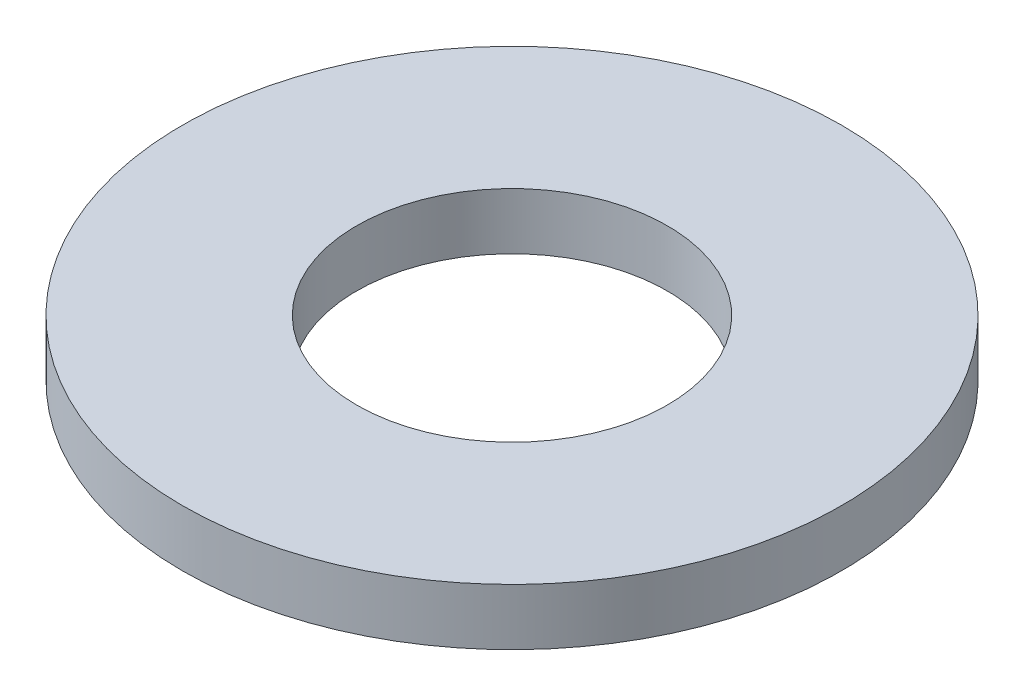
ISO-10303-21;
HEADER;
FILE_DESCRIPTION(('STEP AP214'),'2;1');
FILE_NAME('part.step','',(''),(''),'','','');
FILE_SCHEMA(('AUTOMOTIVE_DESIGN { 1 0 10303 214 1 1 1 1 }'));
ENDSEC;
DATA;
#1=APPLICATION_CONTEXT('core data for automotive mechanical design processes');
#2=APPLICATION_PROTOCOL_DEFINITION('international standard','automotive_design',2000,#1);
#3=PRODUCT_CONTEXT('',#1,'mechanical');
#4=PRODUCT('Part','Part','',(#3));
#5=PRODUCT_RELATED_PRODUCT_CATEGORY('part','',(#4));
#6=PRODUCT_DEFINITION_FORMATION('','',#4);
#7=PRODUCT_DEFINITION_CONTEXT('part definition',#1,'design');
#8=PRODUCT_DEFINITION('design','',#6,#7);
#9=PRODUCT_DEFINITION_SHAPE('','',#8);
#10=(LENGTH_UNIT() NAMED_UNIT(*) SI_UNIT(.MILLI.,.METRE.));
#11=(NAMED_UNIT(*) PLANE_ANGLE_UNIT() SI_UNIT($,.RADIAN.));
#12=(NAMED_UNIT(*) SI_UNIT($,.STERADIAN.) SOLID_ANGLE_UNIT());
#13=UNCERTAINTY_MEASURE_WITH_UNIT(LENGTH_MEASURE(1.E-05),#10,'distance_accuracy_value','');
#14=(GEOMETRIC_REPRESENTATION_CONTEXT(3) GLOBAL_UNCERTAINTY_ASSIGNED_CONTEXT((#13)) GLOBAL_UNIT_ASSIGNED_CONTEXT((#10,
#11,#12)) REPRESENTATION_CONTEXT('',''));
#15=CARTESIAN_POINT('',(0.,0.,0.));
#16=DIRECTION('',(0.,0.,1.));
#17=DIRECTION('',(1.,0.,0.));
#18=AXIS2_PLACEMENT_3D('',#15,#16,#17);
#19=CARTESIAN_POINT('',(0.,0.6,0.));
#20=DIRECTION('',(0.,1.,0.));
#21=DIRECTION('',(0.,0.,1.));
#22=AXIS2_PLACEMENT_3D('',#19,#20,#21);
#23=PLANE('',#22);
#24=CARTESIAN_POINT('',(0.,0.6,0.));
#25=DIRECTION('',(0.,1.,0.));
#26=DIRECTION('',(0.,0.,1.));
#27=AXIS2_PLACEMENT_3D('',#24,#25,#26);
#28=CIRCLE('',#27,3.5);
#29=CARTESIAN_POINT('',(0.,0.6,3.5));
#30=VERTEX_POINT('',#29);
#31=EDGE_CURVE('E10',#30,#30,#28,.T.);
#32=ORIENTED_EDGE('',*,*,#31,.T.);
#33=EDGE_LOOP('',(#32));
#34=FACE_BOUND('',#33,.T.);
#35=CARTESIAN_POINT('',(0.,0.6,0.));
#36=DIRECTION('',(0.,1.,0.));
#37=DIRECTION('',(0.,0.,1.));
#38=AXIS2_PLACEMENT_3D('',#35,#36,#37);
#39=CIRCLE('',#38,1.65);
#40=CARTESIAN_POINT('',(0.,0.6,1.65));
#41=VERTEX_POINT('',#40);
#42=EDGE_CURVE('E42',#41,#41,#39,.T.);
#43=ORIENTED_EDGE('',*,*,#42,.F.);
#44=EDGE_LOOP('',(#43));
#45=FACE_BOUND('',#44,.T.);
#46=ADVANCED_FACE('F31',(#34,#45),#23,.T.);
#47=CARTESIAN_POINT('',(0.,0.,0.));
#48=DIRECTION('',(0.,1.,0.));
#49=DIRECTION('',(0.,0.,1.));
#50=AXIS2_PLACEMENT_3D('',#47,#48,#49);
#51=PLANE('',#50);
#52=CARTESIAN_POINT('',(0.,0.,0.));
#53=DIRECTION('',(0.,1.,0.));
#54=DIRECTION('',(0.,0.,1.));
#55=AXIS2_PLACEMENT_3D('',#52,#53,#54);
#56=CIRCLE('',#55,3.5);
#57=CARTESIAN_POINT('',(0.,0.,3.5));
#58=VERTEX_POINT('',#57);
#59=EDGE_CURVE('E35',#58,#58,#56,.T.);
#60=ORIENTED_EDGE('',*,*,#59,.F.);
#61=EDGE_LOOP('',(#60));
#62=FACE_BOUND('',#61,.T.);
#63=CARTESIAN_POINT('',(0.,0.,0.));
#64=DIRECTION('',(0.,1.,0.));
#65=DIRECTION('',(0.,0.,1.));
#66=AXIS2_PLACEMENT_3D('',#63,#64,#65);
#67=CIRCLE('',#66,1.65);
#68=CARTESIAN_POINT('',(0.,0.,1.65));
#69=VERTEX_POINT('',#68);
#70=EDGE_CURVE('E44',#69,#69,#67,.T.);
#71=ORIENTED_EDGE('',*,*,#70,.T.);
#72=EDGE_LOOP('',(#71));
#73=FACE_BOUND('',#72,.T.);
#74=ADVANCED_FACE('F54',(#62,#73),#51,.F.);
#75=CARTESIAN_POINT('',(0.,0.6,0.));
#76=DIRECTION('',(0.,-1.,0.));
#77=DIRECTION('',(0.,0.,-1.));
#78=AXIS2_PLACEMENT_3D('',#75,#76,#77);
#79=CYLINDRICAL_SURFACE('',#78,3.5);
#80=ORIENTED_EDGE('',*,*,#31,.F.);
#81=EDGE_LOOP('',(#80));
#82=FACE_BOUND('',#81,.T.);
#83=ORIENTED_EDGE('',*,*,#59,.T.);
#84=EDGE_LOOP('',(#83));
#85=FACE_BOUND('',#84,.T.);
#86=ADVANCED_FACE('F33',(#82,#85),#79,.T.);
#87=CARTESIAN_POINT('',(0.,0.6,0.));
#88=DIRECTION('',(0.,-1.,0.));
#89=DIRECTION('',(0.,0.,-1.));
#90=AXIS2_PLACEMENT_3D('',#87,#88,#89);
#91=CYLINDRICAL_SURFACE('',#90,1.65);
#92=ORIENTED_EDGE('',*,*,#42,.T.);
#93=EDGE_LOOP('',(#92));
#94=FACE_BOUND('',#93,.T.);
#95=ORIENTED_EDGE('',*,*,#70,.F.);
#96=EDGE_LOOP('',(#95));
#97=FACE_BOUND('',#96,.T.);
#98=ADVANCED_FACE('F50',(#94,#97),#91,.F.);
#99=CLOSED_SHELL('',(#46,#74,#86,#98));
#100=MANIFOLD_SOLID_BREP('B2',#99);
#101=ADVANCED_BREP_SHAPE_REPRESENTATION('',(#18,#100),#14);
#102=SHAPE_DEFINITION_REPRESENTATION(#9,#101);
ENDSEC;
END-ISO-10303-21;
